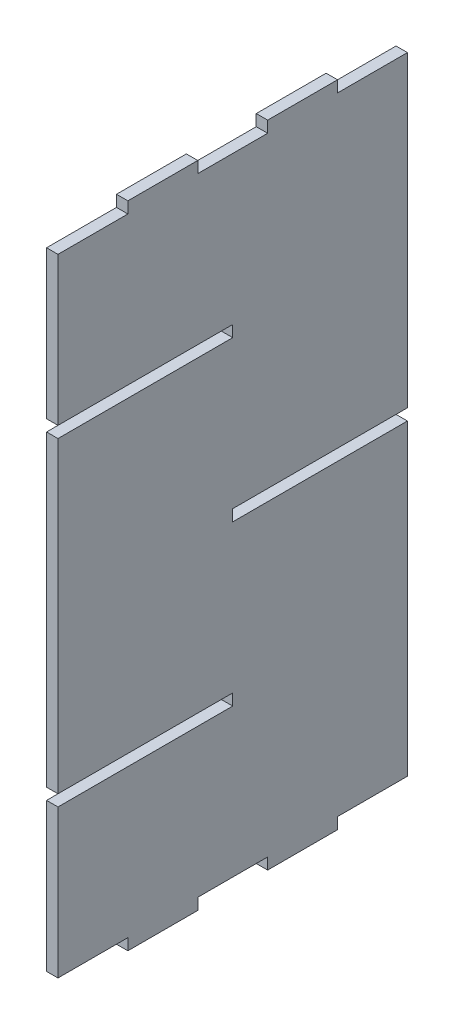
ISO-10303-21;
HEADER;
FILE_DESCRIPTION(('STEP AP214'),'2;1');
FILE_NAME('part.step','',(''),(''),'','','');
FILE_SCHEMA(('AUTOMOTIVE_DESIGN { 1 0 10303 214 1 1 1 1 }'));
ENDSEC;
DATA;
#1=APPLICATION_CONTEXT('core data for automotive mechanical design processes');
#2=APPLICATION_PROTOCOL_DEFINITION('international standard','automotive_design',2000,#1);
#3=PRODUCT_CONTEXT('',#1,'mechanical');
#4=PRODUCT('Part','Part','',(#3));
#5=PRODUCT_RELATED_PRODUCT_CATEGORY('part','',(#4));
#6=PRODUCT_DEFINITION_FORMATION('','',#4);
#7=PRODUCT_DEFINITION_CONTEXT('part definition',#1,'design');
#8=PRODUCT_DEFINITION('design','',#6,#7);
#9=PRODUCT_DEFINITION_SHAPE('','',#8);
#10=(LENGTH_UNIT() NAMED_UNIT(*) SI_UNIT(.MILLI.,.METRE.));
#11=(NAMED_UNIT(*) PLANE_ANGLE_UNIT() SI_UNIT($,.RADIAN.));
#12=(NAMED_UNIT(*) SI_UNIT($,.STERADIAN.) SOLID_ANGLE_UNIT());
#13=UNCERTAINTY_MEASURE_WITH_UNIT(LENGTH_MEASURE(1.E-05),#10,'distance_accuracy_value','');
#14=(GEOMETRIC_REPRESENTATION_CONTEXT(3) GLOBAL_UNCERTAINTY_ASSIGNED_CONTEXT((#13)) GLOBAL_UNIT_ASSIGNED_CONTEXT((#10,
#11,#12)) REPRESENTATION_CONTEXT('',''));
#15=CARTESIAN_POINT('',(0.,0.,0.));
#16=DIRECTION('',(0.,0.,1.));
#17=DIRECTION('',(1.,0.,0.));
#18=AXIS2_PLACEMENT_3D('',#15,#16,#17);
#19=CARTESIAN_POINT('',(1.5,82.5000000000002,-27.6));
#20=DIRECTION('',(0.,-1.,0.));
#21=DIRECTION('',(0.,0.,-1.));
#22=AXIS2_PLACEMENT_3D('',#19,#20,#21);
#23=PLANE('',#22);
#24=DIRECTION('',(0.,0.,1.));
#25=VECTOR('',#24,1.);
#26=CARTESIAN_POINT('',(-1.5,82.5000000000002,-27.6));
#27=LINE('',#26,#25);
#28=CARTESIAN_POINT('',(-1.5,82.5000000000001,-46.));
#29=VERTEX_POINT('',#28);
#30=CARTESIAN_POINT('',(-1.5,82.5000000000002,-27.6));
#31=VERTEX_POINT('',#30);
#32=EDGE_CURVE('E273',#29,#31,#27,.T.);
#33=ORIENTED_EDGE('',*,*,#32,.T.);
#34=DIRECTION('',(-1.,0.,0.));
#35=VECTOR('',#34,1.);
#36=CARTESIAN_POINT('',(1.5,82.5000000000002,-27.6));
#37=LINE('',#36,#35);
#38=CARTESIAN_POINT('',(1.5,82.5000000000002,-27.6));
#39=VERTEX_POINT('',#38);
#40=EDGE_CURVE('E11',#39,#31,#37,.T.);
#41=ORIENTED_EDGE('',*,*,#40,.F.);
#42=DIRECTION('',(0.,0.,1.));
#43=VECTOR('',#42,1.);
#44=CARTESIAN_POINT('',(1.5,82.5000000000002,-27.6));
#45=LINE('',#44,#43);
#46=CARTESIAN_POINT('',(1.5,82.5000000000001,-46.));
#47=VERTEX_POINT('',#46);
#48=EDGE_CURVE('E335',#47,#39,#45,.T.);
#49=ORIENTED_EDGE('',*,*,#48,.F.);
#50=DIRECTION('',(-1.,0.,0.));
#51=VECTOR('',#50,1.);
#52=CARTESIAN_POINT('',(1.5,82.5000000000001,-46.));
#53=LINE('',#52,#51);
#54=EDGE_CURVE('E269',#47,#29,#53,.T.);
#55=ORIENTED_EDGE('',*,*,#54,.T.);
#56=EDGE_LOOP('',(#33,#41,#49,#55));
#57=FACE_BOUND('',#56,.T.);
#58=ADVANCED_FACE('F33',(#57),#23,.F.);
#59=CARTESIAN_POINT('',(1.5,85.5000000000002,-27.6));
#60=DIRECTION('',(0.,0.,1.));
#61=DIRECTION('',(1.,0.,0.));
#62=AXIS2_PLACEMENT_3D('',#59,#60,#61);
#63=PLANE('',#62);
#64=DIRECTION('',(0.,1.,0.));
#65=VECTOR('',#64,1.);
#66=CARTESIAN_POINT('',(-1.5,85.5000000000002,-27.6));
#67=LINE('',#66,#65);
#68=CARTESIAN_POINT('',(-1.5,85.5000000000002,-27.6));
#69=VERTEX_POINT('',#68);
#70=EDGE_CURVE('E276',#31,#69,#67,.T.);
#71=ORIENTED_EDGE('',*,*,#70,.T.);
#72=DIRECTION('',(-1.,0.,0.));
#73=VECTOR('',#72,1.);
#74=CARTESIAN_POINT('',(1.5,85.5000000000002,-27.6));
#75=LINE('',#74,#73);
#76=CARTESIAN_POINT('',(1.5,85.5000000000002,-27.6));
#77=VERTEX_POINT('',#76);
#78=EDGE_CURVE('E41',#77,#69,#75,.T.);
#79=ORIENTED_EDGE('',*,*,#78,.F.);
#80=DIRECTION('',(0.,1.,0.));
#81=VECTOR('',#80,1.);
#82=CARTESIAN_POINT('',(1.5,85.5000000000002,-27.6));
#83=LINE('',#82,#81);
#84=EDGE_CURVE('E164',#39,#77,#83,.T.);
#85=ORIENTED_EDGE('',*,*,#84,.F.);
#86=ORIENTED_EDGE('',*,*,#40,.T.);
#87=EDGE_LOOP('',(#71,#79,#85,#86));
#88=FACE_BOUND('',#87,.T.);
#89=ADVANCED_FACE('F513',(#88),#63,.F.);
#90=CARTESIAN_POINT('',(1.5,85.5000000000002,-9.2));
#91=DIRECTION('',(0.,-1.,0.));
#92=DIRECTION('',(0.,0.,-1.));
#93=AXIS2_PLACEMENT_3D('',#90,#91,#92);
#94=PLANE('',#93);
#95=DIRECTION('',(0.,0.,1.));
#96=VECTOR('',#95,1.);
#97=CARTESIAN_POINT('',(-1.5,85.5000000000002,-9.2));
#98=LINE('',#97,#96);
#99=CARTESIAN_POINT('',(-1.5,85.5000000000002,-9.2));
#100=VERTEX_POINT('',#99);
#101=EDGE_CURVE('E278',#69,#100,#98,.T.);
#102=ORIENTED_EDGE('',*,*,#101,.T.);
#103=DIRECTION('',(-1.,0.,0.));
#104=VECTOR('',#103,1.);
#105=CARTESIAN_POINT('',(1.5,85.5000000000002,-9.2));
#106=LINE('',#105,#104);
#107=CARTESIAN_POINT('',(1.5,85.5000000000002,-9.2));
#108=VERTEX_POINT('',#107);
#109=EDGE_CURVE('E414',#108,#100,#106,.T.);
#110=ORIENTED_EDGE('',*,*,#109,.F.);
#111=DIRECTION('',(0.,0.,1.));
#112=VECTOR('',#111,1.);
#113=CARTESIAN_POINT('',(1.5,85.5000000000002,-9.2));
#114=LINE('',#113,#112);
#115=EDGE_CURVE('E422',#77,#108,#114,.T.);
#116=ORIENTED_EDGE('',*,*,#115,.F.);
#117=ORIENTED_EDGE('',*,*,#78,.T.);
#118=EDGE_LOOP('',(#102,#110,#116,#117));
#119=FACE_BOUND('',#118,.T.);
#120=ADVANCED_FACE('F420',(#119),#94,.F.);
#121=CARTESIAN_POINT('',(1.5,82.5000000000002,-9.2));
#122=DIRECTION('',(0.,0.,-1.));
#123=DIRECTION('',(0.,1.,0.));
#124=AXIS2_PLACEMENT_3D('',#121,#122,#123);
#125=PLANE('',#124);
#126=DIRECTION('',(0.,-1.,0.));
#127=VECTOR('',#126,1.);
#128=CARTESIAN_POINT('',(-1.5,82.5000000000002,-9.2));
#129=LINE('',#128,#127);
#130=CARTESIAN_POINT('',(-1.5,82.5000000000002,-9.2));
#131=VERTEX_POINT('',#130);
#132=EDGE_CURVE('E280',#100,#131,#129,.T.);
#133=ORIENTED_EDGE('',*,*,#132,.T.);
#134=DIRECTION('',(-1.,0.,0.));
#135=VECTOR('',#134,1.);
#136=CARTESIAN_POINT('',(1.5,82.5000000000002,-9.2));
#137=LINE('',#136,#135);
#138=CARTESIAN_POINT('',(1.5,82.5000000000002,-9.2));
#139=VERTEX_POINT('',#138);
#140=EDGE_CURVE('E411',#139,#131,#137,.T.);
#141=ORIENTED_EDGE('',*,*,#140,.F.);
#142=DIRECTION('',(0.,-1.,0.));
#143=VECTOR('',#142,1.);
#144=CARTESIAN_POINT('',(1.5,82.5000000000002,-9.2));
#145=LINE('',#144,#143);
#146=EDGE_CURVE('E440',#108,#139,#145,.T.);
#147=ORIENTED_EDGE('',*,*,#146,.F.);
#148=ORIENTED_EDGE('',*,*,#109,.T.);
#149=EDGE_LOOP('',(#133,#141,#147,#148));
#150=FACE_BOUND('',#149,.T.);
#151=ADVANCED_FACE('F431',(#150),#125,.F.);
#152=CARTESIAN_POINT('',(1.5,82.5000000000002,9.2));
#153=DIRECTION('',(0.,-1.,0.));
#154=DIRECTION('',(0.,0.,-1.));
#155=AXIS2_PLACEMENT_3D('',#152,#153,#154);
#156=PLANE('',#155);
#157=DIRECTION('',(0.,0.,1.));
#158=VECTOR('',#157,1.);
#159=CARTESIAN_POINT('',(-1.5,82.5000000000002,9.2));
#160=LINE('',#159,#158);
#161=CARTESIAN_POINT('',(-1.5,82.5000000000002,9.2));
#162=VERTEX_POINT('',#161);
#163=EDGE_CURVE('E282',#131,#162,#160,.T.);
#164=ORIENTED_EDGE('',*,*,#163,.T.);
#165=DIRECTION('',(-1.,0.,0.));
#166=VECTOR('',#165,1.);
#167=CARTESIAN_POINT('',(1.5,82.5000000000002,9.2));
#168=LINE('',#167,#166);
#169=CARTESIAN_POINT('',(1.5,82.5000000000002,9.2));
#170=VERTEX_POINT('',#169);
#171=EDGE_CURVE('E408',#170,#162,#168,.T.);
#172=ORIENTED_EDGE('',*,*,#171,.F.);
#173=DIRECTION('',(0.,0.,1.));
#174=VECTOR('',#173,1.);
#175=CARTESIAN_POINT('',(1.5,82.5000000000002,9.2));
#176=LINE('',#175,#174);
#177=EDGE_CURVE('E437',#139,#170,#176,.T.);
#178=ORIENTED_EDGE('',*,*,#177,.F.);
#179=ORIENTED_EDGE('',*,*,#140,.T.);
#180=EDGE_LOOP('',(#164,#172,#178,#179));
#181=FACE_BOUND('',#180,.T.);
#182=ADVANCED_FACE('F435',(#181),#156,.F.);
#183=CARTESIAN_POINT('',(1.5,85.5000000000002,9.2));
#184=DIRECTION('',(0.,0.,1.));
#185=DIRECTION('',(1.,0.,0.));
#186=AXIS2_PLACEMENT_3D('',#183,#184,#185);
#187=PLANE('',#186);
#188=DIRECTION('',(0.,1.,0.));
#189=VECTOR('',#188,1.);
#190=CARTESIAN_POINT('',(-1.5,85.5000000000002,9.2));
#191=LINE('',#190,#189);
#192=CARTESIAN_POINT('',(-1.5,85.5000000000002,9.2));
#193=VERTEX_POINT('',#192);
#194=EDGE_CURVE('E284',#162,#193,#191,.T.);
#195=ORIENTED_EDGE('',*,*,#194,.T.);
#196=DIRECTION('',(-1.,0.,0.));
#197=VECTOR('',#196,1.);
#198=CARTESIAN_POINT('',(1.5,85.5000000000002,9.2));
#199=LINE('',#198,#197);
#200=CARTESIAN_POINT('',(1.5,85.5000000000002,9.2));
#201=VERTEX_POINT('',#200);
#202=EDGE_CURVE('E405',#201,#193,#199,.T.);
#203=ORIENTED_EDGE('',*,*,#202,.F.);
#204=DIRECTION('',(0.,1.,0.));
#205=VECTOR('',#204,1.);
#206=CARTESIAN_POINT('',(1.5,85.5000000000002,9.2));
#207=LINE('',#206,#205);
#208=EDGE_CURVE('E439',#170,#201,#207,.T.);
#209=ORIENTED_EDGE('',*,*,#208,.F.);
#210=ORIENTED_EDGE('',*,*,#171,.T.);
#211=EDGE_LOOP('',(#195,#203,#209,#210));
#212=FACE_BOUND('',#211,.T.);
#213=ADVANCED_FACE('F526',(#212),#187,.F.);
#214=CARTESIAN_POINT('',(1.5,85.5000000000002,27.6));
#215=DIRECTION('',(0.,-1.,0.));
#216=DIRECTION('',(0.,0.,-1.));
#217=AXIS2_PLACEMENT_3D('',#214,#215,#216);
#218=PLANE('',#217);
#219=DIRECTION('',(0.,0.,1.));
#220=VECTOR('',#219,1.);
#221=CARTESIAN_POINT('',(-1.5,85.5000000000002,27.6));
#222=LINE('',#221,#220);
#223=CARTESIAN_POINT('',(-1.5,85.5000000000002,27.6));
#224=VERTEX_POINT('',#223);
#225=EDGE_CURVE('E286',#193,#224,#222,.T.);
#226=ORIENTED_EDGE('',*,*,#225,.T.);
#227=DIRECTION('',(-1.,0.,0.));
#228=VECTOR('',#227,1.);
#229=CARTESIAN_POINT('',(1.5,85.5000000000002,27.6));
#230=LINE('',#229,#228);
#231=CARTESIAN_POINT('',(1.5,85.5000000000002,27.6));
#232=VERTEX_POINT('',#231);
#233=EDGE_CURVE('E402',#232,#224,#230,.T.);
#234=ORIENTED_EDGE('',*,*,#233,.F.);
#235=DIRECTION('',(0.,0.,1.));
#236=VECTOR('',#235,1.);
#237=CARTESIAN_POINT('',(1.5,85.5000000000002,27.6));
#238=LINE('',#237,#236);
#239=EDGE_CURVE('E442',#201,#232,#238,.T.);
#240=ORIENTED_EDGE('',*,*,#239,.F.);
#241=ORIENTED_EDGE('',*,*,#202,.T.);
#242=EDGE_LOOP('',(#226,#234,#240,#241));
#243=FACE_BOUND('',#242,.T.);
#244=ADVANCED_FACE('F529',(#243),#218,.F.);
#245=CARTESIAN_POINT('',(1.5,82.5000000000002,27.6));
#246=DIRECTION('',(0.,0.,-1.));
#247=DIRECTION('',(-1.,0.,0.));
#248=AXIS2_PLACEMENT_3D('',#245,#246,#247);
#249=PLANE('',#248);
#250=DIRECTION('',(0.,-1.,0.));
#251=VECTOR('',#250,1.);
#252=CARTESIAN_POINT('',(-1.5,82.5000000000002,27.6));
#253=LINE('',#252,#251);
#254=CARTESIAN_POINT('',(-1.5,82.5000000000002,27.6));
#255=VERTEX_POINT('',#254);
#256=EDGE_CURVE('E288',#224,#255,#253,.T.);
#257=ORIENTED_EDGE('',*,*,#256,.T.);
#258=DIRECTION('',(-1.,0.,0.));
#259=VECTOR('',#258,1.);
#260=CARTESIAN_POINT('',(1.5,82.5000000000002,27.6));
#261=LINE('',#260,#259);
#262=CARTESIAN_POINT('',(1.5,82.5000000000002,27.6));
#263=VERTEX_POINT('',#262);
#264=EDGE_CURVE('E399',#263,#255,#261,.T.);
#265=ORIENTED_EDGE('',*,*,#264,.F.);
#266=DIRECTION('',(0.,-1.,0.));
#267=VECTOR('',#266,1.);
#268=CARTESIAN_POINT('',(1.5,82.5000000000002,27.6));
#269=LINE('',#268,#267);
#270=EDGE_CURVE('E448',#232,#263,#269,.T.);
#271=ORIENTED_EDGE('',*,*,#270,.F.);
#272=ORIENTED_EDGE('',*,*,#233,.T.);
#273=EDGE_LOOP('',(#257,#265,#271,#272));
#274=FACE_BOUND('',#273,.T.);
#275=ADVANCED_FACE('F533',(#274),#249,.F.);
#276=CARTESIAN_POINT('',(1.5,82.5000000000001,46.));
#277=DIRECTION('',(0.,-1.,0.));
#278=DIRECTION('',(0.,0.,-1.));
#279=AXIS2_PLACEMENT_3D('',#276,#277,#278);
#280=PLANE('',#279);
#281=DIRECTION('',(0.,0.,1.));
#282=VECTOR('',#281,1.);
#283=CARTESIAN_POINT('',(-1.5,82.5000000000001,46.));
#284=LINE('',#283,#282);
#285=CARTESIAN_POINT('',(-1.5,82.5000000000001,46.));
#286=VERTEX_POINT('',#285);
#287=EDGE_CURVE('E290',#255,#286,#284,.T.);
#288=ORIENTED_EDGE('',*,*,#287,.T.);
#289=DIRECTION('',(-1.,0.,0.));
#290=VECTOR('',#289,1.);
#291=CARTESIAN_POINT('',(1.5,82.5000000000001,46.));
#292=LINE('',#291,#290);
#293=CARTESIAN_POINT('',(1.5,82.5000000000001,46.));
#294=VERTEX_POINT('',#293);
#295=EDGE_CURVE('E396',#294,#286,#292,.T.);
#296=ORIENTED_EDGE('',*,*,#295,.F.);
#297=DIRECTION('',(0.,0.,1.));
#298=VECTOR('',#297,1.);
#299=CARTESIAN_POINT('',(1.5,82.5000000000001,46.));
#300=LINE('',#299,#298);
#301=EDGE_CURVE('E450',#263,#294,#300,.T.);
#302=ORIENTED_EDGE('',*,*,#301,.F.);
#303=ORIENTED_EDGE('',*,*,#264,.T.);
#304=EDGE_LOOP('',(#288,#296,#302,#303));
#305=FACE_BOUND('',#304,.T.);
#306=ADVANCED_FACE('F537',(#305),#280,.F.);
#307=CARTESIAN_POINT('',(1.5,43.5000000000002,46.));
#308=DIRECTION('',(0.,0.,-1.));
#309=DIRECTION('',(-1.,0.,0.));
#310=AXIS2_PLACEMENT_3D('',#307,#308,#309);
#311=PLANE('',#310);
#312=DIRECTION('',(0.,-1.,0.));
#313=VECTOR('',#312,1.);
#314=CARTESIAN_POINT('',(-1.5,43.5000000000002,46.));
#315=LINE('',#314,#313);
#316=CARTESIAN_POINT('',(-1.5,43.5000000000002,46.));
#317=VERTEX_POINT('',#316);
#318=EDGE_CURVE('E292',#286,#317,#315,.T.);
#319=ORIENTED_EDGE('',*,*,#318,.T.);
#320=DIRECTION('',(-1.,0.,0.));
#321=VECTOR('',#320,1.);
#322=CARTESIAN_POINT('',(1.5,43.5000000000002,46.));
#323=LINE('',#322,#321);
#324=CARTESIAN_POINT('',(1.5,43.5000000000002,46.));
#325=VERTEX_POINT('',#324);
#326=EDGE_CURVE('E393',#325,#317,#323,.T.);
#327=ORIENTED_EDGE('',*,*,#326,.F.);
#328=DIRECTION('',(0.,-1.,0.));
#329=VECTOR('',#328,1.);
#330=CARTESIAN_POINT('',(1.5,43.5000000000002,46.));
#331=LINE('',#330,#329);
#332=EDGE_CURVE('E452',#294,#325,#331,.T.);
#333=ORIENTED_EDGE('',*,*,#332,.F.);
#334=ORIENTED_EDGE('',*,*,#295,.T.);
#335=EDGE_LOOP('',(#319,#327,#333,#334));
#336=FACE_BOUND('',#335,.T.);
#337=ADVANCED_FACE('F541',(#336),#311,.F.);
#338=CARTESIAN_POINT('',(1.5,43.5000000000002,0.));
#339=DIRECTION('',(0.,1.,0.));
#340=DIRECTION('',(0.,0.,1.));
#341=AXIS2_PLACEMENT_3D('',#338,#339,#340);
#342=PLANE('',#341);
#343=DIRECTION('',(0.,0.,-1.));
#344=VECTOR('',#343,1.);
#345=CARTESIAN_POINT('',(-1.5,43.5000000000002,0.));
#346=LINE('',#345,#344);
#347=CARTESIAN_POINT('',(-1.5,43.5000000000002,0.));
#348=VERTEX_POINT('',#347);
#349=EDGE_CURVE('E294',#317,#348,#346,.T.);
#350=ORIENTED_EDGE('',*,*,#349,.T.);
#351=DIRECTION('',(-1.,0.,0.));
#352=VECTOR('',#351,1.);
#353=CARTESIAN_POINT('',(1.5,43.5000000000002,0.));
#354=LINE('',#353,#352);
#355=CARTESIAN_POINT('',(1.5,43.5000000000002,0.));
#356=VERTEX_POINT('',#355);
#357=EDGE_CURVE('E390',#356,#348,#354,.T.);
#358=ORIENTED_EDGE('',*,*,#357,.F.);
#359=DIRECTION('',(0.,0.,-1.));
#360=VECTOR('',#359,1.);
#361=CARTESIAN_POINT('',(1.5,43.5000000000002,0.));
#362=LINE('',#361,#360);
#363=EDGE_CURVE('E454',#325,#356,#362,.T.);
#364=ORIENTED_EDGE('',*,*,#363,.F.);
#365=ORIENTED_EDGE('',*,*,#326,.T.);
#366=EDGE_LOOP('',(#350,#358,#364,#365));
#367=FACE_BOUND('',#366,.T.);
#368=ADVANCED_FACE('F545',(#367),#342,.F.);
#369=CARTESIAN_POINT('',(1.5,40.5000000000003,0.));
#370=DIRECTION('',(0.,0.,-1.));
#371=DIRECTION('',(0.,1.,0.));
#372=AXIS2_PLACEMENT_3D('',#369,#370,#371);
#373=PLANE('',#372);
#374=DIRECTION('',(0.,-1.,0.));
#375=VECTOR('',#374,1.);
#376=CARTESIAN_POINT('',(-1.5,40.5000000000003,0.));
#377=LINE('',#376,#375);
#378=CARTESIAN_POINT('',(-1.5,40.5000000000003,0.));
#379=VERTEX_POINT('',#378);
#380=EDGE_CURVE('E296',#348,#379,#377,.T.);
#381=ORIENTED_EDGE('',*,*,#380,.T.);
#382=DIRECTION('',(-1.,0.,0.));
#383=VECTOR('',#382,1.);
#384=CARTESIAN_POINT('',(1.5,40.5000000000003,0.));
#385=LINE('',#384,#383);
#386=CARTESIAN_POINT('',(1.5,40.5000000000003,0.));
#387=VERTEX_POINT('',#386);
#388=EDGE_CURVE('E387',#387,#379,#385,.T.);
#389=ORIENTED_EDGE('',*,*,#388,.F.);
#390=DIRECTION('',(0.,-1.,0.));
#391=VECTOR('',#390,1.);
#392=CARTESIAN_POINT('',(1.5,40.5000000000003,0.));
#393=LINE('',#392,#391);
#394=EDGE_CURVE('E456',#356,#387,#393,.T.);
#395=ORIENTED_EDGE('',*,*,#394,.F.);
#396=ORIENTED_EDGE('',*,*,#357,.T.);
#397=EDGE_LOOP('',(#381,#389,#395,#396));
#398=FACE_BOUND('',#397,.T.);
#399=ADVANCED_FACE('F549',(#398),#373,.F.);
#400=CARTESIAN_POINT('',(1.5,40.5000000000002,46.));
#401=DIRECTION('',(0.,-1.,0.));
#402=DIRECTION('',(0.,0.,-1.));
#403=AXIS2_PLACEMENT_3D('',#400,#401,#402);
#404=PLANE('',#403);
#405=DIRECTION('',(0.,0.,1.));
#406=VECTOR('',#405,1.);
#407=CARTESIAN_POINT('',(-1.5,40.5000000000002,46.));
#408=LINE('',#407,#406);
#409=CARTESIAN_POINT('',(-1.5,40.5000000000002,46.));
#410=VERTEX_POINT('',#409);
#411=EDGE_CURVE('E298',#379,#410,#408,.T.);
#412=ORIENTED_EDGE('',*,*,#411,.T.);
#413=DIRECTION('',(-1.,0.,0.));
#414=VECTOR('',#413,1.);
#415=CARTESIAN_POINT('',(1.5,40.5000000000002,46.));
#416=LINE('',#415,#414);
#417=CARTESIAN_POINT('',(1.5,40.5000000000002,46.));
#418=VERTEX_POINT('',#417);
#419=EDGE_CURVE('E384',#418,#410,#416,.T.);
#420=ORIENTED_EDGE('',*,*,#419,.F.);
#421=DIRECTION('',(0.,0.,1.));
#422=VECTOR('',#421,1.);
#423=CARTESIAN_POINT('',(1.5,40.5000000000002,46.));
#424=LINE('',#423,#422);
#425=EDGE_CURVE('E458',#387,#418,#424,.T.);
#426=ORIENTED_EDGE('',*,*,#425,.F.);
#427=ORIENTED_EDGE('',*,*,#388,.T.);
#428=EDGE_LOOP('',(#412,#420,#426,#427));
#429=FACE_BOUND('',#428,.T.);
#430=ADVANCED_FACE('F553',(#429),#404,.F.);
#431=CARTESIAN_POINT('',(1.5,-40.5,46.));
#432=DIRECTION('',(0.,0.,-1.));
#433=DIRECTION('',(-1.,0.,0.));
#434=AXIS2_PLACEMENT_3D('',#431,#432,#433);
#435=PLANE('',#434);
#436=DIRECTION('',(0.,-1.,0.));
#437=VECTOR('',#436,1.);
#438=CARTESIAN_POINT('',(-1.5,-40.5,46.));
#439=LINE('',#438,#437);
#440=CARTESIAN_POINT('',(-1.5,-40.5,46.));
#441=VERTEX_POINT('',#440);
#442=EDGE_CURVE('E300',#410,#441,#439,.T.);
#443=ORIENTED_EDGE('',*,*,#442,.T.);
#444=DIRECTION('',(-1.,0.,0.));
#445=VECTOR('',#444,1.);
#446=CARTESIAN_POINT('',(1.5,-40.5,46.));
#447=LINE('',#446,#445);
#448=CARTESIAN_POINT('',(1.5,-40.5,46.));
#449=VERTEX_POINT('',#448);
#450=EDGE_CURVE('E381',#449,#441,#447,.T.);
#451=ORIENTED_EDGE('',*,*,#450,.F.);
#452=DIRECTION('',(0.,-1.,0.));
#453=VECTOR('',#452,1.);
#454=CARTESIAN_POINT('',(1.5,-40.5,46.));
#455=LINE('',#454,#453);
#456=EDGE_CURVE('E460',#418,#449,#455,.T.);
#457=ORIENTED_EDGE('',*,*,#456,.F.);
#458=ORIENTED_EDGE('',*,*,#419,.T.);
#459=EDGE_LOOP('',(#443,#451,#457,#458));
#460=FACE_BOUND('',#459,.T.);
#461=ADVANCED_FACE('F557',(#460),#435,.F.);
#462=CARTESIAN_POINT('',(1.5,-40.5000000000001,0.));
#463=DIRECTION('',(0.,1.,0.));
#464=DIRECTION('',(0.,0.,1.));
#465=AXIS2_PLACEMENT_3D('',#462,#463,#464);
#466=PLANE('',#465);
#467=DIRECTION('',(0.,0.,-1.));
#468=VECTOR('',#467,1.);
#469=CARTESIAN_POINT('',(-1.5,-40.5000000000001,0.));
#470=LINE('',#469,#468);
#471=CARTESIAN_POINT('',(-1.5,-40.5000000000001,0.));
#472=VERTEX_POINT('',#471);
#473=EDGE_CURVE('E302',#441,#472,#470,.T.);
#474=ORIENTED_EDGE('',*,*,#473,.T.);
#475=DIRECTION('',(-1.,0.,0.));
#476=VECTOR('',#475,1.);
#477=CARTESIAN_POINT('',(1.5,-40.5000000000001,0.));
#478=LINE('',#477,#476);
#479=CARTESIAN_POINT('',(1.5,-40.5000000000001,0.));
#480=VERTEX_POINT('',#479);
#481=EDGE_CURVE('E378',#480,#472,#478,.T.);
#482=ORIENTED_EDGE('',*,*,#481,.F.);
#483=DIRECTION('',(0.,0.,-1.));
#484=VECTOR('',#483,1.);
#485=CARTESIAN_POINT('',(1.5,-40.5000000000001,0.));
#486=LINE('',#485,#484);
#487=EDGE_CURVE('E462',#449,#480,#486,.T.);
#488=ORIENTED_EDGE('',*,*,#487,.F.);
#489=ORIENTED_EDGE('',*,*,#450,.T.);
#490=EDGE_LOOP('',(#474,#482,#488,#489));
#491=FACE_BOUND('',#490,.T.);
#492=ADVANCED_FACE('F561',(#491),#466,.F.);
#493=CARTESIAN_POINT('',(1.5,-43.5000000000002,0.));
#494=DIRECTION('',(0.,0.,-1.));
#495=DIRECTION('',(0.,1.,0.));
#496=AXIS2_PLACEMENT_3D('',#493,#494,#495);
#497=PLANE('',#496);
#498=DIRECTION('',(0.,-1.,0.));
#499=VECTOR('',#498,1.);
#500=CARTESIAN_POINT('',(-1.5,-43.5000000000002,0.));
#501=LINE('',#500,#499);
#502=CARTESIAN_POINT('',(-1.5,-43.5000000000002,0.));
#503=VERTEX_POINT('',#502);
#504=EDGE_CURVE('E304',#472,#503,#501,.T.);
#505=ORIENTED_EDGE('',*,*,#504,.T.);
#506=DIRECTION('',(-1.,0.,0.));
#507=VECTOR('',#506,1.);
#508=CARTESIAN_POINT('',(1.5,-43.5000000000002,0.));
#509=LINE('',#508,#507);
#510=CARTESIAN_POINT('',(1.5,-43.5000000000002,0.));
#511=VERTEX_POINT('',#510);
#512=EDGE_CURVE('E375',#511,#503,#509,.T.);
#513=ORIENTED_EDGE('',*,*,#512,.F.);
#514=DIRECTION('',(0.,-1.,0.));
#515=VECTOR('',#514,1.);
#516=CARTESIAN_POINT('',(1.5,-43.5000000000002,0.));
#517=LINE('',#516,#515);
#518=EDGE_CURVE('E464',#480,#511,#517,.T.);
#519=ORIENTED_EDGE('',*,*,#518,.F.);
#520=ORIENTED_EDGE('',*,*,#481,.T.);
#521=EDGE_LOOP('',(#505,#513,#519,#520));
#522=FACE_BOUND('',#521,.T.);
#523=ADVANCED_FACE('F565',(#522),#497,.F.);
#524=CARTESIAN_POINT('',(1.5,-43.5000000000001,46.));
#525=DIRECTION('',(0.,-1.,0.));
#526=DIRECTION('',(0.,0.,-1.));
#527=AXIS2_PLACEMENT_3D('',#524,#525,#526);
#528=PLANE('',#527);
#529=DIRECTION('',(0.,0.,1.));
#530=VECTOR('',#529,1.);
#531=CARTESIAN_POINT('',(-1.5,-43.5000000000001,46.));
#532=LINE('',#531,#530);
#533=CARTESIAN_POINT('',(-1.5,-43.5000000000001,46.));
#534=VERTEX_POINT('',#533);
#535=EDGE_CURVE('E306',#503,#534,#532,.T.);
#536=ORIENTED_EDGE('',*,*,#535,.T.);
#537=DIRECTION('',(-1.,0.,0.));
#538=VECTOR('',#537,1.);
#539=CARTESIAN_POINT('',(1.5,-43.5000000000001,46.));
#540=LINE('',#539,#538);
#541=CARTESIAN_POINT('',(1.5,-43.5000000000001,46.));
#542=VERTEX_POINT('',#541);
#543=EDGE_CURVE('E372',#542,#534,#540,.T.);
#544=ORIENTED_EDGE('',*,*,#543,.F.);
#545=DIRECTION('',(0.,0.,1.));
#546=VECTOR('',#545,1.);
#547=CARTESIAN_POINT('',(1.5,-43.5000000000001,46.));
#548=LINE('',#547,#546);
#549=EDGE_CURVE('E466',#511,#542,#548,.T.);
#550=ORIENTED_EDGE('',*,*,#549,.F.);
#551=ORIENTED_EDGE('',*,*,#512,.T.);
#552=EDGE_LOOP('',(#536,#544,#550,#551));
#553=FACE_BOUND('',#552,.T.);
#554=ADVANCED_FACE('F569',(#553),#528,.F.);
#555=CARTESIAN_POINT('',(1.5,-82.5000000000001,46.));
#556=DIRECTION('',(0.,0.,-1.));
#557=DIRECTION('',(-1.,0.,0.));
#558=AXIS2_PLACEMENT_3D('',#555,#556,#557);
#559=PLANE('',#558);
#560=DIRECTION('',(0.,-1.,0.));
#561=VECTOR('',#560,1.);
#562=CARTESIAN_POINT('',(-1.5,-82.5000000000001,46.));
#563=LINE('',#562,#561);
#564=CARTESIAN_POINT('',(-1.5,-82.5000000000001,46.));
#565=VERTEX_POINT('',#564);
#566=EDGE_CURVE('E308',#534,#565,#563,.T.);
#567=ORIENTED_EDGE('',*,*,#566,.T.);
#568=DIRECTION('',(-1.,0.,0.));
#569=VECTOR('',#568,1.);
#570=CARTESIAN_POINT('',(1.5,-82.5000000000001,46.));
#571=LINE('',#570,#569);
#572=CARTESIAN_POINT('',(1.5,-82.5000000000001,46.));
#573=VERTEX_POINT('',#572);
#574=EDGE_CURVE('E369',#573,#565,#571,.T.);
#575=ORIENTED_EDGE('',*,*,#574,.F.);
#576=DIRECTION('',(0.,-1.,0.));
#577=VECTOR('',#576,1.);
#578=CARTESIAN_POINT('',(1.5,-82.5000000000001,46.));
#579=LINE('',#578,#577);
#580=EDGE_CURVE('E468',#542,#573,#579,.T.);
#581=ORIENTED_EDGE('',*,*,#580,.F.);
#582=ORIENTED_EDGE('',*,*,#543,.T.);
#583=EDGE_LOOP('',(#567,#575,#581,#582));
#584=FACE_BOUND('',#583,.T.);
#585=ADVANCED_FACE('F573',(#584),#559,.F.);
#586=CARTESIAN_POINT('',(1.5,-82.5000000000001,46.));
#587=DIRECTION('',(0.,1.,0.));
#588=DIRECTION('',(0.,0.,1.));
#589=AXIS2_PLACEMENT_3D('',#586,#587,#588);
#590=PLANE('',#589);
#591=DIRECTION('',(0.,0.,-1.));
#592=VECTOR('',#591,1.);
#593=CARTESIAN_POINT('',(-1.5,-82.5000000000001,46.));
#594=LINE('',#593,#592);
#595=CARTESIAN_POINT('',(-1.5,-82.5000000000002,27.6));
#596=VERTEX_POINT('',#595);
#597=EDGE_CURVE('E310',#565,#596,#594,.T.);
#598=ORIENTED_EDGE('',*,*,#597,.T.);
#599=DIRECTION('',(-1.,0.,0.));
#600=VECTOR('',#599,1.);
#601=CARTESIAN_POINT('',(1.5,-82.5000000000002,27.6));
#602=LINE('',#601,#600);
#603=CARTESIAN_POINT('',(1.5,-82.5000000000002,27.6));
#604=VERTEX_POINT('',#603);
#605=EDGE_CURVE('E366',#604,#596,#602,.T.);
#606=ORIENTED_EDGE('',*,*,#605,.F.);
#607=DIRECTION('',(0.,0.,-1.));
#608=VECTOR('',#607,1.);
#609=CARTESIAN_POINT('',(1.5,-82.5000000000001,46.));
#610=LINE('',#609,#608);
#611=EDGE_CURVE('E470',#573,#604,#610,.T.);
#612=ORIENTED_EDGE('',*,*,#611,.F.);
#613=ORIENTED_EDGE('',*,*,#574,.T.);
#614=EDGE_LOOP('',(#598,#606,#612,#613));
#615=FACE_BOUND('',#614,.T.);
#616=ADVANCED_FACE('F577',(#615),#590,.F.);
#617=CARTESIAN_POINT('',(1.5,-82.5000000000002,27.6));
#618=DIRECTION('',(0.,0.,-1.));
#619=DIRECTION('',(0.,1.,0.));
#620=AXIS2_PLACEMENT_3D('',#617,#618,#619);
#621=PLANE('',#620);
#622=DIRECTION('',(0.,-1.,0.));
#623=VECTOR('',#622,1.);
#624=CARTESIAN_POINT('',(-1.5,-82.5000000000002,27.6));
#625=LINE('',#624,#623);
#626=CARTESIAN_POINT('',(-1.5,-85.5000000000002,27.6));
#627=VERTEX_POINT('',#626);
#628=EDGE_CURVE('E312',#596,#627,#625,.T.);
#629=ORIENTED_EDGE('',*,*,#628,.T.);
#630=DIRECTION('',(-1.,0.,0.));
#631=VECTOR('',#630,1.);
#632=CARTESIAN_POINT('',(1.5,-85.5000000000002,27.6));
#633=LINE('',#632,#631);
#634=CARTESIAN_POINT('',(1.5,-85.5000000000002,27.6));
#635=VERTEX_POINT('',#634);
#636=EDGE_CURVE('E363',#635,#627,#633,.T.);
#637=ORIENTED_EDGE('',*,*,#636,.F.);
#638=DIRECTION('',(0.,-1.,0.));
#639=VECTOR('',#638,1.);
#640=CARTESIAN_POINT('',(1.5,-82.5000000000002,27.6));
#641=LINE('',#640,#639);
#642=EDGE_CURVE('E472',#604,#635,#641,.T.);
#643=ORIENTED_EDGE('',*,*,#642,.F.);
#644=ORIENTED_EDGE('',*,*,#605,.T.);
#645=EDGE_LOOP('',(#629,#637,#643,#644));
#646=FACE_BOUND('',#645,.T.);
#647=ADVANCED_FACE('F581',(#646),#621,.F.);
#648=CARTESIAN_POINT('',(1.5,-85.5000000000002,27.6));
#649=DIRECTION('',(0.,1.,0.));
#650=DIRECTION('',(0.,0.,1.));
#651=AXIS2_PLACEMENT_3D('',#648,#649,#650);
#652=PLANE('',#651);
#653=DIRECTION('',(0.,0.,-1.));
#654=VECTOR('',#653,1.);
#655=CARTESIAN_POINT('',(-1.5,-85.5000000000002,27.6));
#656=LINE('',#655,#654);
#657=CARTESIAN_POINT('',(-1.5,-85.5000000000002,9.19999999999996));
#658=VERTEX_POINT('',#657);
#659=EDGE_CURVE('E314',#627,#658,#656,.T.);
#660=ORIENTED_EDGE('',*,*,#659,.T.);
#661=DIRECTION('',(-1.,0.,0.));
#662=VECTOR('',#661,1.);
#663=CARTESIAN_POINT('',(1.5,-85.5000000000002,9.19999999999996));
#664=LINE('',#663,#662);
#665=CARTESIAN_POINT('',(1.5,-85.5000000000002,9.19999999999996));
#666=VERTEX_POINT('',#665);
#667=EDGE_CURVE('E360',#666,#658,#664,.T.);
#668=ORIENTED_EDGE('',*,*,#667,.F.);
#669=DIRECTION('',(0.,0.,-1.));
#670=VECTOR('',#669,1.);
#671=CARTESIAN_POINT('',(1.5,-85.5000000000002,27.6));
#672=LINE('',#671,#670);
#673=EDGE_CURVE('E474',#635,#666,#672,.T.);
#674=ORIENTED_EDGE('',*,*,#673,.F.);
#675=ORIENTED_EDGE('',*,*,#636,.T.);
#676=EDGE_LOOP('',(#660,#668,#674,#675));
#677=FACE_BOUND('',#676,.T.);
#678=ADVANCED_FACE('F585',(#677),#652,.F.);
#679=CARTESIAN_POINT('',(1.5,-85.5000000000002,9.19999999999996));
#680=DIRECTION('',(0.,0.,1.));
#681=DIRECTION('',(0.,-1.,0.));
#682=AXIS2_PLACEMENT_3D('',#679,#680,#681);
#683=PLANE('',#682);
#684=DIRECTION('',(0.,1.,0.));
#685=VECTOR('',#684,1.);
#686=CARTESIAN_POINT('',(-1.5,-85.5000000000002,9.19999999999996));
#687=LINE('',#686,#685);
#688=CARTESIAN_POINT('',(-1.5,-82.5000000000002,9.19999999999995));
#689=VERTEX_POINT('',#688);
#690=EDGE_CURVE('E316',#658,#689,#687,.T.);
#691=ORIENTED_EDGE('',*,*,#690,.T.);
#692=DIRECTION('',(-1.,0.,0.));
#693=VECTOR('',#692,1.);
#694=CARTESIAN_POINT('',(1.5,-82.5000000000002,9.19999999999995));
#695=LINE('',#694,#693);
#696=CARTESIAN_POINT('',(1.5,-82.5000000000002,9.19999999999995));
#697=VERTEX_POINT('',#696);
#698=EDGE_CURVE('E357',#697,#689,#695,.T.);
#699=ORIENTED_EDGE('',*,*,#698,.F.);
#700=DIRECTION('',(0.,1.,0.));
#701=VECTOR('',#700,1.);
#702=CARTESIAN_POINT('',(1.5,-85.5000000000002,9.19999999999996));
#703=LINE('',#702,#701);
#704=EDGE_CURVE('E476',#666,#697,#703,.T.);
#705=ORIENTED_EDGE('',*,*,#704,.F.);
#706=ORIENTED_EDGE('',*,*,#667,.T.);
#707=EDGE_LOOP('',(#691,#699,#705,#706));
#708=FACE_BOUND('',#707,.T.);
#709=ADVANCED_FACE('F589',(#708),#683,.F.);
#710=CARTESIAN_POINT('',(1.5,-82.5000000000002,9.19999999999995));
#711=DIRECTION('',(0.,1.,0.));
#712=DIRECTION('',(0.,0.,1.));
#713=AXIS2_PLACEMENT_3D('',#710,#711,#712);
#714=PLANE('',#713);
#715=DIRECTION('',(0.,0.,-1.));
#716=VECTOR('',#715,1.);
#717=CARTESIAN_POINT('',(-1.5,-82.5000000000002,9.19999999999995));
#718=LINE('',#717,#716);
#719=CARTESIAN_POINT('',(-1.5,-82.5000000000002,-9.2));
#720=VERTEX_POINT('',#719);
#721=EDGE_CURVE('E318',#689,#720,#718,.T.);
#722=ORIENTED_EDGE('',*,*,#721,.T.);
#723=DIRECTION('',(-1.,0.,0.));
#724=VECTOR('',#723,1.);
#725=CARTESIAN_POINT('',(1.5,-82.5000000000002,-9.2));
#726=LINE('',#725,#724);
#727=CARTESIAN_POINT('',(1.5,-82.5000000000002,-9.2));
#728=VERTEX_POINT('',#727);
#729=EDGE_CURVE('E354',#728,#720,#726,.T.);
#730=ORIENTED_EDGE('',*,*,#729,.F.);
#731=DIRECTION('',(0.,0.,-1.));
#732=VECTOR('',#731,1.);
#733=CARTESIAN_POINT('',(1.5,-82.5000000000002,9.19999999999995));
#734=LINE('',#733,#732);
#735=EDGE_CURVE('E478',#697,#728,#734,.T.);
#736=ORIENTED_EDGE('',*,*,#735,.F.);
#737=ORIENTED_EDGE('',*,*,#698,.T.);
#738=EDGE_LOOP('',(#722,#730,#736,#737));
#739=FACE_BOUND('',#738,.T.);
#740=ADVANCED_FACE('F593',(#739),#714,.F.);
#741=CARTESIAN_POINT('',(1.5,-82.5000000000002,-9.2));
#742=DIRECTION('',(0.,0.,-1.));
#743=DIRECTION('',(0.,1.,0.));
#744=AXIS2_PLACEMENT_3D('',#741,#742,#743);
#745=PLANE('',#744);
#746=DIRECTION('',(0.,-1.,0.));
#747=VECTOR('',#746,1.);
#748=CARTESIAN_POINT('',(-1.5,-82.5000000000002,-9.2));
#749=LINE('',#748,#747);
#750=CARTESIAN_POINT('',(-1.5,-85.5000000000002,-9.2));
#751=VERTEX_POINT('',#750);
#752=EDGE_CURVE('E320',#720,#751,#749,.T.);
#753=ORIENTED_EDGE('',*,*,#752,.T.);
#754=DIRECTION('',(-1.,0.,0.));
#755=VECTOR('',#754,1.);
#756=CARTESIAN_POINT('',(1.5,-85.5000000000002,-9.2));
#757=LINE('',#756,#755);
#758=CARTESIAN_POINT('',(1.5,-85.5000000000002,-9.2));
#759=VERTEX_POINT('',#758);
#760=EDGE_CURVE('E351',#759,#751,#757,.T.);
#761=ORIENTED_EDGE('',*,*,#760,.F.);
#762=DIRECTION('',(0.,-1.,0.));
#763=VECTOR('',#762,1.);
#764=CARTESIAN_POINT('',(1.5,-82.5000000000002,-9.2));
#765=LINE('',#764,#763);
#766=EDGE_CURVE('E480',#728,#759,#765,.T.);
#767=ORIENTED_EDGE('',*,*,#766,.F.);
#768=ORIENTED_EDGE('',*,*,#729,.T.);
#769=EDGE_LOOP('',(#753,#761,#767,#768));
#770=FACE_BOUND('',#769,.T.);
#771=ADVANCED_FACE('F597',(#770),#745,.F.);
#772=CARTESIAN_POINT('',(1.5,-85.5000000000002,-9.2));
#773=DIRECTION('',(0.,1.,0.));
#774=DIRECTION('',(0.,0.,1.));
#775=AXIS2_PLACEMENT_3D('',#772,#773,#774);
#776=PLANE('',#775);
#777=DIRECTION('',(0.,0.,-1.));
#778=VECTOR('',#777,1.);
#779=CARTESIAN_POINT('',(-1.5,-85.5000000000002,-9.2));
#780=LINE('',#779,#778);
#781=CARTESIAN_POINT('',(-1.5,-85.5000000000002,-27.6));
#782=VERTEX_POINT('',#781);
#783=EDGE_CURVE('E322',#751,#782,#780,.T.);
#784=ORIENTED_EDGE('',*,*,#783,.T.);
#785=DIRECTION('',(-1.,0.,0.));
#786=VECTOR('',#785,1.);
#787=CARTESIAN_POINT('',(1.5,-85.5000000000002,-27.6));
#788=LINE('',#787,#786);
#789=CARTESIAN_POINT('',(1.5,-85.5000000000002,-27.6));
#790=VERTEX_POINT('',#789);
#791=EDGE_CURVE('E348',#790,#782,#788,.T.);
#792=ORIENTED_EDGE('',*,*,#791,.F.);
#793=DIRECTION('',(0.,0.,-1.));
#794=VECTOR('',#793,1.);
#795=CARTESIAN_POINT('',(1.5,-85.5000000000002,-9.2));
#796=LINE('',#795,#794);
#797=EDGE_CURVE('E482',#759,#790,#796,.T.);
#798=ORIENTED_EDGE('',*,*,#797,.F.);
#799=ORIENTED_EDGE('',*,*,#760,.T.);
#800=EDGE_LOOP('',(#784,#792,#798,#799));
#801=FACE_BOUND('',#800,.T.);
#802=ADVANCED_FACE('F601',(#801),#776,.F.);
#803=CARTESIAN_POINT('',(1.5,-85.5000000000002,-27.6));
#804=DIRECTION('',(0.,0.,1.));
#805=DIRECTION('',(0.,-1.,0.));
#806=AXIS2_PLACEMENT_3D('',#803,#804,#805);
#807=PLANE('',#806);
#808=DIRECTION('',(0.,1.,0.));
#809=VECTOR('',#808,1.);
#810=CARTESIAN_POINT('',(-1.5,-85.5000000000002,-27.6));
#811=LINE('',#810,#809);
#812=CARTESIAN_POINT('',(-1.5,-82.5000000000002,-27.6));
#813=VERTEX_POINT('',#812);
#814=EDGE_CURVE('E324',#782,#813,#811,.T.);
#815=ORIENTED_EDGE('',*,*,#814,.T.);
#816=DIRECTION('',(-1.,0.,0.));
#817=VECTOR('',#816,1.);
#818=CARTESIAN_POINT('',(1.5,-82.5000000000002,-27.6));
#819=LINE('',#818,#817);
#820=CARTESIAN_POINT('',(1.5,-82.5000000000002,-27.6));
#821=VERTEX_POINT('',#820);
#822=EDGE_CURVE('E345',#821,#813,#819,.T.);
#823=ORIENTED_EDGE('',*,*,#822,.F.);
#824=DIRECTION('',(0.,1.,0.));
#825=VECTOR('',#824,1.);
#826=CARTESIAN_POINT('',(1.5,-85.5000000000002,-27.6));
#827=LINE('',#826,#825);
#828=EDGE_CURVE('E484',#790,#821,#827,.T.);
#829=ORIENTED_EDGE('',*,*,#828,.F.);
#830=ORIENTED_EDGE('',*,*,#791,.T.);
#831=EDGE_LOOP('',(#815,#823,#829,#830));
#832=FACE_BOUND('',#831,.T.);
#833=ADVANCED_FACE('F605',(#832),#807,.F.);
#834=CARTESIAN_POINT('',(1.5,-82.5000000000002,-27.6));
#835=DIRECTION('',(0.,1.,0.));
#836=DIRECTION('',(0.,0.,1.));
#837=AXIS2_PLACEMENT_3D('',#834,#835,#836);
#838=PLANE('',#837);
#839=DIRECTION('',(0.,0.,-1.));
#840=VECTOR('',#839,1.);
#841=CARTESIAN_POINT('',(-1.5,-82.5000000000002,-27.6));
#842=LINE('',#841,#840);
#843=CARTESIAN_POINT('',(-1.5,-82.5000000000001,-46.));
#844=VERTEX_POINT('',#843);
#845=EDGE_CURVE('E326',#813,#844,#842,.T.);
#846=ORIENTED_EDGE('',*,*,#845,.T.);
#847=DIRECTION('',(-1.,0.,0.));
#848=VECTOR('',#847,1.);
#849=CARTESIAN_POINT('',(1.5,-82.5000000000001,-46.));
#850=LINE('',#849,#848);
#851=CARTESIAN_POINT('',(1.5,-82.5000000000001,-46.));
#852=VERTEX_POINT('',#851);
#853=EDGE_CURVE('E342',#852,#844,#850,.T.);
#854=ORIENTED_EDGE('',*,*,#853,.F.);
#855=DIRECTION('',(0.,0.,-1.));
#856=VECTOR('',#855,1.);
#857=CARTESIAN_POINT('',(1.5,-82.5000000000002,-27.6));
#858=LINE('',#857,#856);
#859=EDGE_CURVE('E486',#821,#852,#858,.T.);
#860=ORIENTED_EDGE('',*,*,#859,.F.);
#861=ORIENTED_EDGE('',*,*,#822,.T.);
#862=EDGE_LOOP('',(#846,#854,#860,#861));
#863=FACE_BOUND('',#862,.T.);
#864=ADVANCED_FACE('F609',(#863),#838,.F.);
#865=CARTESIAN_POINT('',(1.5,-82.5000000000001,-46.));
#866=DIRECTION('',(0.,0.,1.));
#867=DIRECTION('',(1.,0.,0.));
#868=AXIS2_PLACEMENT_3D('',#865,#866,#867);
#869=PLANE('',#868);
#870=DIRECTION('',(0.,1.,0.));
#871=VECTOR('',#870,1.);
#872=CARTESIAN_POINT('',(-1.5,-82.5000000000001,-46.));
#873=LINE('',#872,#871);
#874=CARTESIAN_POINT('',(-1.5,-1.49999999999997,-46.));
#875=VERTEX_POINT('',#874);
#876=EDGE_CURVE('E328',#844,#875,#873,.T.);
#877=ORIENTED_EDGE('',*,*,#876,.T.);
#878=DIRECTION('',(-1.,0.,0.));
#879=VECTOR('',#878,1.);
#880=CARTESIAN_POINT('',(1.5,-1.49999999999997,-46.));
#881=LINE('',#880,#879);
#882=CARTESIAN_POINT('',(1.5,-1.49999999999997,-46.));
#883=VERTEX_POINT('',#882);
#884=EDGE_CURVE('E339',#883,#875,#881,.T.);
#885=ORIENTED_EDGE('',*,*,#884,.F.);
#886=DIRECTION('',(0.,1.,0.));
#887=VECTOR('',#886,1.);
#888=CARTESIAN_POINT('',(1.5,-82.5000000000001,-46.));
#889=LINE('',#888,#887);
#890=EDGE_CURVE('E488',#852,#883,#889,.T.);
#891=ORIENTED_EDGE('',*,*,#890,.F.);
#892=ORIENTED_EDGE('',*,*,#853,.T.);
#893=EDGE_LOOP('',(#877,#885,#891,#892));
#894=FACE_BOUND('',#893,.T.);
#895=ADVANCED_FACE('F494',(#894),#869,.F.);
#896=CARTESIAN_POINT('',(1.5,-1.49999999999997,-46.));
#897=DIRECTION('',(0.,-1.,0.));
#898=DIRECTION('',(0.,0.,-1.));
#899=AXIS2_PLACEMENT_3D('',#896,#897,#898);
#900=PLANE('',#899);
#901=DIRECTION('',(0.,0.,1.));
#902=VECTOR('',#901,1.);
#903=CARTESIAN_POINT('',(-1.5,-1.49999999999997,-46.));
#904=LINE('',#903,#902);
#905=CARTESIAN_POINT('',(-1.5,-1.49999999999988,0.));
#906=VERTEX_POINT('',#905);
#907=EDGE_CURVE('E330',#875,#906,#904,.T.);
#908=ORIENTED_EDGE('',*,*,#907,.T.);
#909=DIRECTION('',(-1.,0.,0.));
#910=VECTOR('',#909,1.);
#911=CARTESIAN_POINT('',(1.5,-1.49999999999988,0.));
#912=LINE('',#911,#910);
#913=CARTESIAN_POINT('',(1.5,-1.49999999999988,0.));
#914=VERTEX_POINT('',#913);
#915=EDGE_CURVE('E264',#914,#906,#912,.T.);
#916=ORIENTED_EDGE('',*,*,#915,.F.);
#917=DIRECTION('',(0.,0.,1.));
#918=VECTOR('',#917,1.);
#919=CARTESIAN_POINT('',(1.5,-1.49999999999997,-46.));
#920=LINE('',#919,#918);
#921=EDGE_CURVE('E255',#883,#914,#920,.T.);
#922=ORIENTED_EDGE('',*,*,#921,.F.);
#923=ORIENTED_EDGE('',*,*,#884,.T.);
#924=EDGE_LOOP('',(#908,#916,#922,#923));
#925=FACE_BOUND('',#924,.T.);
#926=ADVANCED_FACE('F498',(#925),#900,.F.);
#927=CARTESIAN_POINT('',(1.5,-1.49999999999988,0.));
#928=DIRECTION('',(0.,0.,1.));
#929=DIRECTION('',(1.,0.,0.));
#930=AXIS2_PLACEMENT_3D('',#927,#928,#929);
#931=PLANE('',#930);
#932=DIRECTION('',(0.,1.,0.));
#933=VECTOR('',#932,1.);
#934=CARTESIAN_POINT('',(-1.5,-1.49999999999988,0.));
#935=LINE('',#934,#933);
#936=CARTESIAN_POINT('',(-1.5,1.50000000000009,0.));
#937=VERTEX_POINT('',#936);
#938=EDGE_CURVE('E263',#906,#937,#935,.T.);
#939=ORIENTED_EDGE('',*,*,#938,.T.);
#940=DIRECTION('',(-1.,0.,0.));
#941=VECTOR('',#940,1.);
#942=CARTESIAN_POINT('',(1.5,1.50000000000009,0.));
#943=LINE('',#942,#941);
#944=CARTESIAN_POINT('',(1.5,1.50000000000009,0.));
#945=VERTEX_POINT('',#944);
#946=EDGE_CURVE('E260',#945,#937,#943,.T.);
#947=ORIENTED_EDGE('',*,*,#946,.F.);
#948=DIRECTION('',(0.,1.,0.));
#949=VECTOR('',#948,1.);
#950=CARTESIAN_POINT('',(1.5,-1.49999999999988,0.));
#951=LINE('',#950,#949);
#952=EDGE_CURVE('E249',#914,#945,#951,.T.);
#953=ORIENTED_EDGE('',*,*,#952,.F.);
#954=ORIENTED_EDGE('',*,*,#915,.T.);
#955=EDGE_LOOP('',(#939,#947,#953,#954));
#956=FACE_BOUND('',#955,.T.);
#957=ADVANCED_FACE('F261',(#956),#931,.F.);
#958=CARTESIAN_POINT('',(1.5,1.50000000000009,0.));
#959=DIRECTION('',(0.,1.,0.));
#960=DIRECTION('',(0.,0.,1.));
#961=AXIS2_PLACEMENT_3D('',#958,#959,#960);
#962=PLANE('',#961);
#963=DIRECTION('',(0.,0.,-1.));
#964=VECTOR('',#963,1.);
#965=CARTESIAN_POINT('',(-1.5,1.50000000000009,0.));
#966=LINE('',#965,#964);
#967=CARTESIAN_POINT('',(-1.5,1.50000000000009,-46.));
#968=VERTEX_POINT('',#967);
#969=EDGE_CURVE('E150',#937,#968,#966,.T.);
#970=ORIENTED_EDGE('',*,*,#969,.T.);
#971=DIRECTION('',(-1.,0.,0.));
#972=VECTOR('',#971,1.);
#973=CARTESIAN_POINT('',(1.5,1.50000000000009,-46.));
#974=LINE('',#973,#972);
#975=CARTESIAN_POINT('',(1.5,1.50000000000009,-46.));
#976=VERTEX_POINT('',#975);
#977=EDGE_CURVE('E265',#976,#968,#974,.T.);
#978=ORIENTED_EDGE('',*,*,#977,.F.);
#979=DIRECTION('',(0.,0.,-1.));
#980=VECTOR('',#979,1.);
#981=CARTESIAN_POINT('',(1.5,1.50000000000009,0.));
#982=LINE('',#981,#980);
#983=EDGE_CURVE('E253',#945,#976,#982,.T.);
#984=ORIENTED_EDGE('',*,*,#983,.F.);
#985=ORIENTED_EDGE('',*,*,#946,.T.);
#986=EDGE_LOOP('',(#970,#978,#984,#985));
#987=FACE_BOUND('',#986,.T.);
#988=ADVANCED_FACE('F267',(#987),#962,.F.);
#989=CARTESIAN_POINT('',(1.5,1.50000000000009,-46.));
#990=DIRECTION('',(0.,0.,1.));
#991=DIRECTION('',(1.,0.,0.));
#992=AXIS2_PLACEMENT_3D('',#989,#990,#991);
#993=PLANE('',#992);
#994=DIRECTION('',(0.,1.,0.));
#995=VECTOR('',#994,1.);
#996=CARTESIAN_POINT('',(-1.5,1.50000000000009,-46.));
#997=LINE('',#996,#995);
#998=EDGE_CURVE('E156',#968,#29,#997,.T.);
#999=ORIENTED_EDGE('',*,*,#998,.T.);
#1000=ORIENTED_EDGE('',*,*,#54,.F.);
#1001=DIRECTION('',(0.,1.,0.));
#1002=VECTOR('',#1001,1.);
#1003=CARTESIAN_POINT('',(1.5,1.50000000000009,-46.));
#1004=LINE('',#1003,#1002);
#1005=EDGE_CURVE('E49',#976,#47,#1004,.T.);
#1006=ORIENTED_EDGE('',*,*,#1005,.F.);
#1007=ORIENTED_EDGE('',*,*,#977,.T.);
#1008=EDGE_LOOP('',(#999,#1000,#1006,#1007));
#1009=FACE_BOUND('',#1008,.T.);
#1010=ADVANCED_FACE('F502',(#1009),#993,.F.);
#1011=CARTESIAN_POINT('',(1.5,0.,0.));
#1012=DIRECTION('',(1.,0.,0.));
#1013=DIRECTION('',(0.,0.,-1.));
#1014=AXIS2_PLACEMENT_3D('',#1011,#1012,#1013);
#1015=PLANE('',#1014);
#1016=ORIENTED_EDGE('',*,*,#48,.T.);
#1017=ORIENTED_EDGE('',*,*,#84,.T.);
#1018=ORIENTED_EDGE('',*,*,#115,.T.);
#1019=ORIENTED_EDGE('',*,*,#146,.T.);
#1020=ORIENTED_EDGE('',*,*,#177,.T.);
#1021=ORIENTED_EDGE('',*,*,#208,.T.);
#1022=ORIENTED_EDGE('',*,*,#239,.T.);
#1023=ORIENTED_EDGE('',*,*,#270,.T.);
#1024=ORIENTED_EDGE('',*,*,#301,.T.);
#1025=ORIENTED_EDGE('',*,*,#332,.T.);
#1026=ORIENTED_EDGE('',*,*,#363,.T.);
#1027=ORIENTED_EDGE('',*,*,#394,.T.);
#1028=ORIENTED_EDGE('',*,*,#425,.T.);
#1029=ORIENTED_EDGE('',*,*,#456,.T.);
#1030=ORIENTED_EDGE('',*,*,#487,.T.);
#1031=ORIENTED_EDGE('',*,*,#518,.T.);
#1032=ORIENTED_EDGE('',*,*,#549,.T.);
#1033=ORIENTED_EDGE('',*,*,#580,.T.);
#1034=ORIENTED_EDGE('',*,*,#611,.T.);
#1035=ORIENTED_EDGE('',*,*,#642,.T.);
#1036=ORIENTED_EDGE('',*,*,#673,.T.);
#1037=ORIENTED_EDGE('',*,*,#704,.T.);
#1038=ORIENTED_EDGE('',*,*,#735,.T.);
#1039=ORIENTED_EDGE('',*,*,#766,.T.);
#1040=ORIENTED_EDGE('',*,*,#797,.T.);
#1041=ORIENTED_EDGE('',*,*,#828,.T.);
#1042=ORIENTED_EDGE('',*,*,#859,.T.);
#1043=ORIENTED_EDGE('',*,*,#890,.T.);
#1044=ORIENTED_EDGE('',*,*,#921,.T.);
#1045=ORIENTED_EDGE('',*,*,#952,.T.);
#1046=ORIENTED_EDGE('',*,*,#983,.T.);
#1047=ORIENTED_EDGE('',*,*,#1005,.T.);
#1048=EDGE_LOOP('',(#1016,#1017,#1018,#1019,#1020,#1021,#1022,#1023,#1024,#1025,#1026,#1027,
#1028,#1029,#1030,#1031,#1032,#1033,#1034,#1035,#1036,#1037,#1038,#1039,#1040,#1041,#1042,#1043,
#1044,#1045,#1046,#1047));
#1049=FACE_BOUND('',#1048,.T.);
#1050=ADVANCED_FACE('F251',(#1049),#1015,.T.);
#1051=CARTESIAN_POINT('',(-1.5,0.,0.));
#1052=DIRECTION('',(1.,0.,0.));
#1053=DIRECTION('',(0.,0.,-1.));
#1054=AXIS2_PLACEMENT_3D('',#1051,#1052,#1053);
#1055=PLANE('',#1054);
#1056=ORIENTED_EDGE('',*,*,#32,.F.);
#1057=ORIENTED_EDGE('',*,*,#998,.F.);
#1058=ORIENTED_EDGE('',*,*,#969,.F.);
#1059=ORIENTED_EDGE('',*,*,#938,.F.);
#1060=ORIENTED_EDGE('',*,*,#907,.F.);
#1061=ORIENTED_EDGE('',*,*,#876,.F.);
#1062=ORIENTED_EDGE('',*,*,#845,.F.);
#1063=ORIENTED_EDGE('',*,*,#814,.F.);
#1064=ORIENTED_EDGE('',*,*,#783,.F.);
#1065=ORIENTED_EDGE('',*,*,#752,.F.);
#1066=ORIENTED_EDGE('',*,*,#721,.F.);
#1067=ORIENTED_EDGE('',*,*,#690,.F.);
#1068=ORIENTED_EDGE('',*,*,#659,.F.);
#1069=ORIENTED_EDGE('',*,*,#628,.F.);
#1070=ORIENTED_EDGE('',*,*,#597,.F.);
#1071=ORIENTED_EDGE('',*,*,#566,.F.);
#1072=ORIENTED_EDGE('',*,*,#535,.F.);
#1073=ORIENTED_EDGE('',*,*,#504,.F.);
#1074=ORIENTED_EDGE('',*,*,#473,.F.);
#1075=ORIENTED_EDGE('',*,*,#442,.F.);
#1076=ORIENTED_EDGE('',*,*,#411,.F.);
#1077=ORIENTED_EDGE('',*,*,#380,.F.);
#1078=ORIENTED_EDGE('',*,*,#349,.F.);
#1079=ORIENTED_EDGE('',*,*,#318,.F.);
#1080=ORIENTED_EDGE('',*,*,#287,.F.);
#1081=ORIENTED_EDGE('',*,*,#256,.F.);
#1082=ORIENTED_EDGE('',*,*,#225,.F.);
#1083=ORIENTED_EDGE('',*,*,#194,.F.);
#1084=ORIENTED_EDGE('',*,*,#163,.F.);
#1085=ORIENTED_EDGE('',*,*,#132,.F.);
#1086=ORIENTED_EDGE('',*,*,#101,.F.);
#1087=ORIENTED_EDGE('',*,*,#70,.F.);
#1088=EDGE_LOOP('',(#1056,#1057,#1058,#1059,#1060,#1061,#1062,#1063,#1064,#1065,#1066,#1067,
#1068,#1069,#1070,#1071,#1072,#1073,#1074,#1075,#1076,#1077,#1078,#1079,#1080,#1081,#1082,#1083,
#1084,#1085,#1086,#1087));
#1089=FACE_BOUND('',#1088,.T.);
#1090=ADVANCED_FACE('F426',(#1089),#1055,.F.);
#1091=CLOSED_SHELL('',(#58,#89,#120,#151,#182,#213,#244,#275,#306,#337,#368,#399,#430,#461,#492,
#523,#554,#585,#616,#647,#678,#709,#740,#771,#802,#833,#864,#895,#926,#957,#988,#1010,#1050,#1090));
#1092=MANIFOLD_SOLID_BREP('B2',#1091);
#1093=ADVANCED_BREP_SHAPE_REPRESENTATION('',(#18,#1092),#14);
#1094=SHAPE_DEFINITION_REPRESENTATION(#9,#1093);
ENDSEC;
END-ISO-10303-21;
